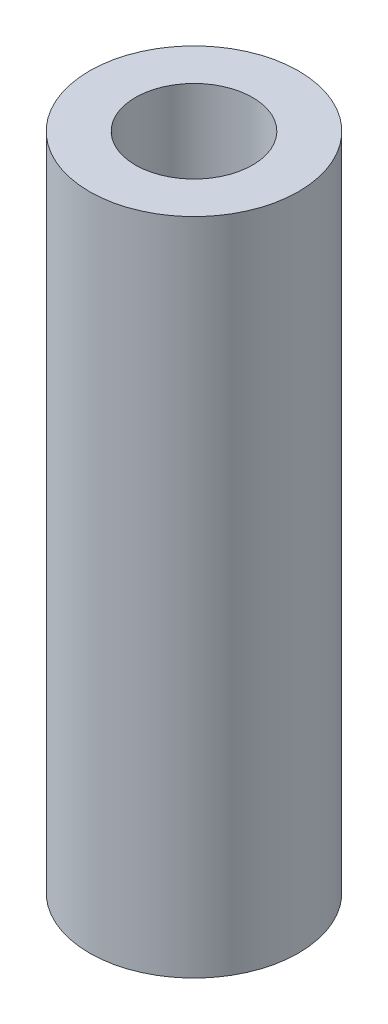
ISO-10303-21;
HEADER;
FILE_DESCRIPTION(('STEP AP214'),'2;1');
FILE_NAME('part.step','',(''),(''),'','','');
FILE_SCHEMA(('AUTOMOTIVE_DESIGN { 1 0 10303 214 1 1 1 1 }'));
ENDSEC;
DATA;
#1=APPLICATION_CONTEXT('core data for automotive mechanical design processes');
#2=APPLICATION_PROTOCOL_DEFINITION('international standard','automotive_design',2000,#1);
#3=PRODUCT_CONTEXT('',#1,'mechanical');
#4=PRODUCT('Part','Part','',(#3));
#5=PRODUCT_RELATED_PRODUCT_CATEGORY('part','',(#4));
#6=PRODUCT_DEFINITION_FORMATION('','',#4);
#7=PRODUCT_DEFINITION_CONTEXT('part definition',#1,'design');
#8=PRODUCT_DEFINITION('design','',#6,#7);
#9=PRODUCT_DEFINITION_SHAPE('','',#8);
#10=(LENGTH_UNIT() NAMED_UNIT(*) SI_UNIT(.MILLI.,.METRE.));
#11=(NAMED_UNIT(*) PLANE_ANGLE_UNIT() SI_UNIT($,.RADIAN.));
#12=(NAMED_UNIT(*) SI_UNIT($,.STERADIAN.) SOLID_ANGLE_UNIT());
#13=UNCERTAINTY_MEASURE_WITH_UNIT(LENGTH_MEASURE(1.E-05),#10,'distance_accuracy_value','');
#14=(GEOMETRIC_REPRESENTATION_CONTEXT(3) GLOBAL_UNCERTAINTY_ASSIGNED_CONTEXT((#13)) GLOBAL_UNIT_ASSIGNED_CONTEXT((#10,
#11,#12)) REPRESENTATION_CONTEXT('',''));
#15=CARTESIAN_POINT('',(0.,0.,0.));
#16=DIRECTION('',(0.,0.,1.));
#17=DIRECTION('',(1.,0.,0.));
#18=AXIS2_PLACEMENT_3D('',#15,#16,#17);
#19=CARTESIAN_POINT('',(0.,18.2245,0.));
#20=DIRECTION('',(0.,1.,0.));
#21=DIRECTION('',(0.,0.,1.));
#22=AXIS2_PLACEMENT_3D('',#19,#20,#21);
#23=PLANE('',#22);
#24=CARTESIAN_POINT('',(0.,18.2245,0.));
#25=DIRECTION('',(0.,1.,0.));
#26=DIRECTION('',(0.,0.,1.));
#27=AXIS2_PLACEMENT_3D('',#24,#25,#26);
#28=CIRCLE('',#27,5.7785);
#29=CARTESIAN_POINT('',(0.,18.2245,5.7785));
#30=VERTEX_POINT('',#29);
#31=EDGE_CURVE('E10',#30,#30,#28,.T.);
#32=ORIENTED_EDGE('',*,*,#31,.T.);
#33=EDGE_LOOP('',(#32));
#34=FACE_BOUND('',#33,.T.);
#35=CARTESIAN_POINT('',(0.,18.2245,0.));
#36=DIRECTION('',(0.,1.,0.));
#37=DIRECTION('',(0.,0.,1.));
#38=AXIS2_PLACEMENT_3D('',#35,#36,#37);
#39=CIRCLE('',#38,3.2385);
#40=CARTESIAN_POINT('',(0.,18.2245,3.2385));
#41=VERTEX_POINT('',#40);
#42=EDGE_CURVE('E42',#41,#41,#39,.T.);
#43=ORIENTED_EDGE('',*,*,#42,.F.);
#44=EDGE_LOOP('',(#43));
#45=FACE_BOUND('',#44,.T.);
#46=ADVANCED_FACE('F31',(#34,#45),#23,.T.);
#47=CARTESIAN_POINT('',(0.,-18.2245,0.));
#48=DIRECTION('',(0.,1.,0.));
#49=DIRECTION('',(0.,0.,1.));
#50=AXIS2_PLACEMENT_3D('',#47,#48,#49);
#51=PLANE('',#50);
#52=CARTESIAN_POINT('',(0.,-18.2245,0.));
#53=DIRECTION('',(0.,1.,0.));
#54=DIRECTION('',(0.,0.,1.));
#55=AXIS2_PLACEMENT_3D('',#52,#53,#54);
#56=CIRCLE('',#55,5.7785);
#57=CARTESIAN_POINT('',(0.,-18.2245,5.7785));
#58=VERTEX_POINT('',#57);
#59=EDGE_CURVE('E35',#58,#58,#56,.T.);
#60=ORIENTED_EDGE('',*,*,#59,.F.);
#61=EDGE_LOOP('',(#60));
#62=FACE_BOUND('',#61,.T.);
#63=CARTESIAN_POINT('',(0.,-18.2245,0.));
#64=DIRECTION('',(0.,1.,0.));
#65=DIRECTION('',(0.,0.,1.));
#66=AXIS2_PLACEMENT_3D('',#63,#64,#65);
#67=CIRCLE('',#66,3.2385);
#68=CARTESIAN_POINT('',(0.,-18.2245,3.2385));
#69=VERTEX_POINT('',#68);
#70=EDGE_CURVE('E44',#69,#69,#67,.T.);
#71=ORIENTED_EDGE('',*,*,#70,.T.);
#72=EDGE_LOOP('',(#71));
#73=FACE_BOUND('',#72,.T.);
#74=ADVANCED_FACE('F54',(#62,#73),#51,.F.);
#75=CARTESIAN_POINT('',(0.,18.2245,0.));
#76=DIRECTION('',(0.,-1.,0.));
#77=DIRECTION('',(0.,0.,-1.));
#78=AXIS2_PLACEMENT_3D('',#75,#76,#77);
#79=CYLINDRICAL_SURFACE('',#78,5.7785);
#80=ORIENTED_EDGE('',*,*,#31,.F.);
#81=EDGE_LOOP('',(#80));
#82=FACE_BOUND('',#81,.T.);
#83=ORIENTED_EDGE('',*,*,#59,.T.);
#84=EDGE_LOOP('',(#83));
#85=FACE_BOUND('',#84,.T.);
#86=ADVANCED_FACE('F33',(#82,#85),#79,.T.);
#87=CARTESIAN_POINT('',(0.,18.2245,0.));
#88=DIRECTION('',(0.,-1.,0.));
#89=DIRECTION('',(0.,0.,-1.));
#90=AXIS2_PLACEMENT_3D('',#87,#88,#89);
#91=CYLINDRICAL_SURFACE('',#90,3.2385);
#92=ORIENTED_EDGE('',*,*,#42,.T.);
#93=EDGE_LOOP('',(#92));
#94=FACE_BOUND('',#93,.T.);
#95=ORIENTED_EDGE('',*,*,#70,.F.);
#96=EDGE_LOOP('',(#95));
#97=FACE_BOUND('',#96,.T.);
#98=ADVANCED_FACE('F50',(#94,#97),#91,.F.);
#99=CLOSED_SHELL('',(#46,#74,#86,#98));
#100=MANIFOLD_SOLID_BREP('B2',#99);
#101=ADVANCED_BREP_SHAPE_REPRESENTATION('',(#18,#100),#14);
#102=SHAPE_DEFINITION_REPRESENTATION(#9,#101);
ENDSEC;
END-ISO-10303-21;
